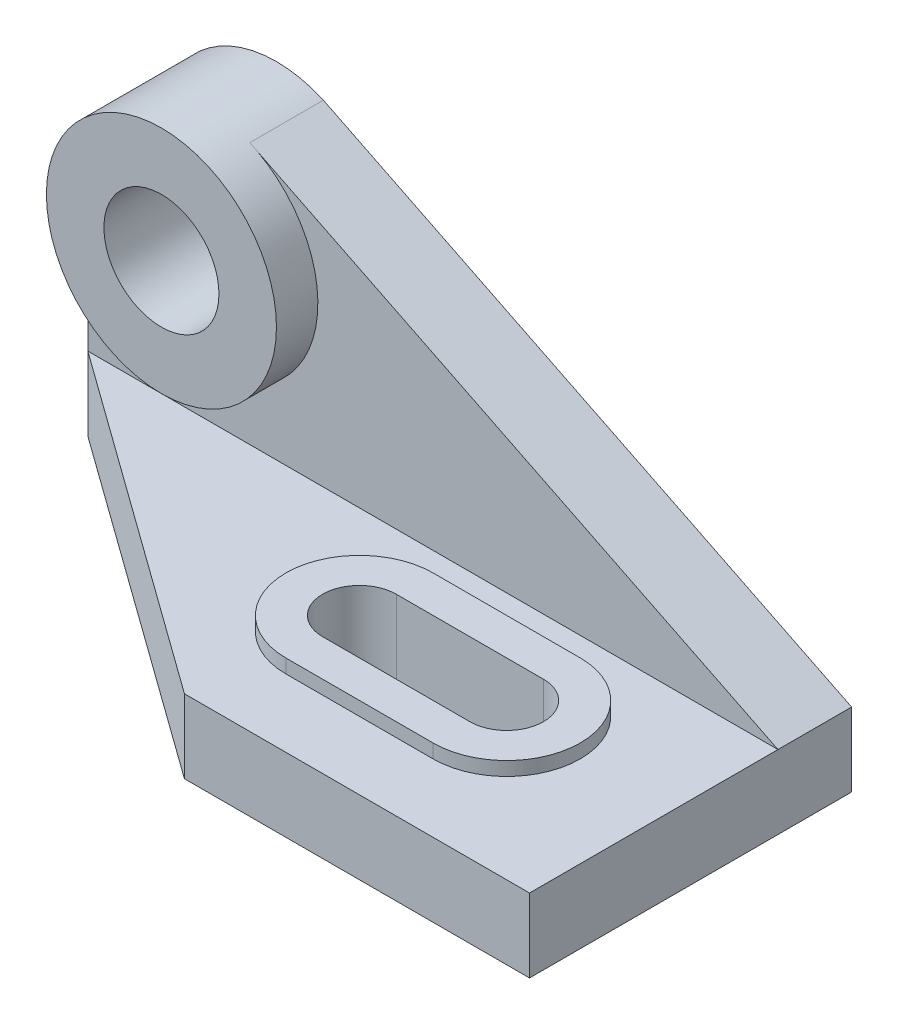
ISO-10303-21;
HEADER;
FILE_DESCRIPTION(('STEP AP214'),'2;1');
FILE_NAME('part.step','',(''),(''),'','','');
FILE_SCHEMA(('AUTOMOTIVE_DESIGN { 1 0 10303 214 1 1 1 1 }'));
ENDSEC;
DATA;
#1=APPLICATION_CONTEXT('core data for automotive mechanical design processes');
#2=APPLICATION_PROTOCOL_DEFINITION('international standard','automotive_design',2000,#1);
#3=PRODUCT_CONTEXT('',#1,'mechanical');
#4=PRODUCT('Part','Part','',(#3));
#5=PRODUCT_RELATED_PRODUCT_CATEGORY('part','',(#4));
#6=PRODUCT_DEFINITION_FORMATION('','',#4);
#7=PRODUCT_DEFINITION_CONTEXT('part definition',#1,'design');
#8=PRODUCT_DEFINITION('design','',#6,#7);
#9=PRODUCT_DEFINITION_SHAPE('','',#8);
#10=(LENGTH_UNIT() NAMED_UNIT(*) SI_UNIT(.MILLI.,.METRE.));
#11=(NAMED_UNIT(*) PLANE_ANGLE_UNIT() SI_UNIT($,.RADIAN.));
#12=(NAMED_UNIT(*) SI_UNIT($,.STERADIAN.) SOLID_ANGLE_UNIT());
#13=UNCERTAINTY_MEASURE_WITH_UNIT(LENGTH_MEASURE(1.E-05),#10,'distance_accuracy_value','');
#14=(GEOMETRIC_REPRESENTATION_CONTEXT(3) GLOBAL_UNCERTAINTY_ASSIGNED_CONTEXT((#13)) GLOBAL_UNIT_ASSIGNED_CONTEXT((#10,
#11,#12)) REPRESENTATION_CONTEXT('',''));
#15=CARTESIAN_POINT('',(0.,0.,0.));
#16=DIRECTION('',(0.,0.,1.));
#17=DIRECTION('',(1.,0.,0.));
#18=AXIS2_PLACEMENT_3D('',#15,#16,#17);
#19=CARTESIAN_POINT('',(47.7217497126448,3.,39.2415568663609));
#20=DIRECTION('',(0.,1.,0.));
#21=DIRECTION('',(0.,0.,1.));
#22=AXIS2_PLACEMENT_3D('',#19,#20,#21);
#23=PLANE('',#22);
#24=CARTESIAN_POINT('',(47.7217497126448,3.,39.2415568663609));
#25=DIRECTION('',(0.,1.,0.));
#26=DIRECTION('',(0.,0.,1.));
#27=AXIS2_PLACEMENT_3D('',#24,#25,#26);
#28=CIRCLE('',#27,16.);
#29=CARTESIAN_POINT('',(47.7217497126448,3.,55.2415568663609));
#30=VERTEX_POINT('',#29);
#31=CARTESIAN_POINT('',(47.7217497126448,3.,23.2415568663609));
#32=VERTEX_POINT('',#31);
#33=EDGE_CURVE('E309',#30,#32,#28,.T.);
#34=ORIENTED_EDGE('',*,*,#33,.T.);
#35=DIRECTION('',(-1.,0.,0.));
#36=VECTOR('',#35,1.);
#37=CARTESIAN_POINT('',(47.7217497126448,3.,23.2415568663609));
#38=LINE('',#37,#36);
#39=CARTESIAN_POINT('',(15.7217497126448,3.,23.2415568663609));
#40=VERTEX_POINT('',#39);
#41=EDGE_CURVE('E325',#32,#40,#38,.T.);
#42=ORIENTED_EDGE('',*,*,#41,.T.);
#43=CARTESIAN_POINT('',(15.7217497126448,3.,39.2415568663609));
#44=DIRECTION('',(0.,1.,0.));
#45=DIRECTION('',(0.,0.,1.));
#46=AXIS2_PLACEMENT_3D('',#43,#44,#45);
#47=CIRCLE('',#46,16.);
#48=CARTESIAN_POINT('',(15.7217497126448,3.,55.2415568663609));
#49=VERTEX_POINT('',#48);
#50=EDGE_CURVE('E322',#40,#49,#47,.T.);
#51=ORIENTED_EDGE('',*,*,#50,.T.);
#52=DIRECTION('',(1.,0.,0.));
#53=VECTOR('',#52,1.);
#54=CARTESIAN_POINT('',(47.7217497126448,3.,55.2415568663609));
#55=LINE('',#54,#53);
#56=EDGE_CURVE('E305',#49,#30,#55,.T.);
#57=ORIENTED_EDGE('',*,*,#56,.T.);
#58=EDGE_LOOP('',(#34,#42,#51,#57));
#59=FACE_BOUND('',#58,.T.);
#60=DIRECTION('',(1.,0.,0.));
#61=VECTOR('',#60,1.);
#62=CARTESIAN_POINT('',(47.7217497126448,3.,31.2415568663609));
#63=LINE('',#62,#61);
#64=CARTESIAN_POINT('',(15.7217497126448,3.,31.2415568663609));
#65=VERTEX_POINT('',#64);
#66=CARTESIAN_POINT('',(47.7217497126448,3.,31.2415568663609));
#67=VERTEX_POINT('',#66);
#68=EDGE_CURVE('E52',#65,#67,#63,.T.);
#69=ORIENTED_EDGE('',*,*,#68,.T.);
#70=CARTESIAN_POINT('',(47.7217497126448,3.,39.2415568663609));
#71=DIRECTION('',(0.,1.,0.));
#72=DIRECTION('',(0.,0.,1.));
#73=AXIS2_PLACEMENT_3D('',#70,#71,#72);
#74=CIRCLE('',#73,8.);
#75=CARTESIAN_POINT('',(47.7217497126448,3.,47.2415568663609));
#76=VERTEX_POINT('',#75);
#77=EDGE_CURVE('E11',#67,#76,#74,.F.);
#78=ORIENTED_EDGE('',*,*,#77,.T.);
#79=DIRECTION('',(-1.,0.,0.));
#80=VECTOR('',#79,1.);
#81=CARTESIAN_POINT('',(47.7217497126448,3.,47.2415568663609));
#82=LINE('',#81,#80);
#83=CARTESIAN_POINT('',(15.7217497126448,3.,47.2415568663609));
#84=VERTEX_POINT('',#83);
#85=EDGE_CURVE('E166',#76,#84,#82,.T.);
#86=ORIENTED_EDGE('',*,*,#85,.T.);
#87=CARTESIAN_POINT('',(15.7217497126448,3.,39.2415568663609));
#88=DIRECTION('',(0.,1.,0.));
#89=DIRECTION('',(0.,0.,1.));
#90=AXIS2_PLACEMENT_3D('',#87,#88,#89);
#91=CIRCLE('',#90,8.);
#92=EDGE_CURVE('E171',#84,#65,#91,.F.);
#93=ORIENTED_EDGE('',*,*,#92,.T.);
#94=EDGE_LOOP('',(#69,#78,#86,#93));
#95=FACE_BOUND('',#94,.T.);
#96=ADVANCED_FACE('F43',(#59,#95),#23,.T.);
#97=CARTESIAN_POINT('',(0.,0.,0.));
#98=DIRECTION('',(0.,1.,0.));
#99=DIRECTION('',(0.,0.,1.));
#100=AXIS2_PLACEMENT_3D('',#97,#98,#99);
#101=PLANE('',#100);
#102=DIRECTION('',(1.,0.,0.));
#103=VECTOR('',#102,1.);
#104=CARTESIAN_POINT('',(83.4429861704843,0.,16.));
#105=LINE('',#104,#103);
#106=CARTESIAN_POINT('',(-66.5570138295157,0.,16.));
#107=VERTEX_POINT('',#106);
#108=CARTESIAN_POINT('',(83.4429861704843,0.,16.));
#109=VERTEX_POINT('',#108);
#110=EDGE_CURVE('E254',#107,#109,#105,.T.);
#111=ORIENTED_EDGE('',*,*,#110,.F.);
#112=DIRECTION('',(-0.811534341451494,0.,-0.584304725845076));
#113=VECTOR('',#112,1.);
#114=CARTESIAN_POINT('',(8.44298617048435,0.,70.));
#115=LINE('',#114,#113);
#116=CARTESIAN_POINT('',(8.44298617048435,0.,70.));
#117=VERTEX_POINT('',#116);
#118=EDGE_CURVE('E247',#117,#107,#115,.T.);
#119=ORIENTED_EDGE('',*,*,#118,.F.);
#120=DIRECTION('',(-1.,0.,0.));
#121=VECTOR('',#120,1.);
#122=CARTESIAN_POINT('',(83.4429861704843,0.,70.));
#123=LINE('',#122,#121);
#124=CARTESIAN_POINT('',(83.4429861704843,0.,70.));
#125=VERTEX_POINT('',#124);
#126=EDGE_CURVE('E261',#125,#117,#123,.T.);
#127=ORIENTED_EDGE('',*,*,#126,.F.);
#128=DIRECTION('',(0.,0.,1.));
#129=VECTOR('',#128,1.);
#130=CARTESIAN_POINT('',(83.4429861704843,0.,16.));
#131=LINE('',#130,#129);
#132=EDGE_CURVE('E265',#109,#125,#131,.T.);
#133=ORIENTED_EDGE('',*,*,#132,.F.);
#134=EDGE_LOOP('',(#111,#119,#127,#133));
#135=FACE_BOUND('',#134,.T.);
#136=DIRECTION('',(-1.,0.,0.));
#137=VECTOR('',#136,1.);
#138=CARTESIAN_POINT('',(47.7217497126448,0.,23.2415568663609));
#139=LINE('',#138,#137);
#140=CARTESIAN_POINT('',(47.7217497126448,0.,23.2415568663609));
#141=VERTEX_POINT('',#140);
#142=CARTESIAN_POINT('',(15.7217497126448,0.,23.2415568663609));
#143=VERTEX_POINT('',#142);
#144=EDGE_CURVE('E313',#141,#143,#139,.T.);
#145=ORIENTED_EDGE('',*,*,#144,.F.);
#146=CARTESIAN_POINT('',(47.7217497126448,0.,39.2415568663609));
#147=DIRECTION('',(0.,1.,0.));
#148=DIRECTION('',(0.,0.,1.));
#149=AXIS2_PLACEMENT_3D('',#146,#147,#148);
#150=CIRCLE('',#149,16.);
#151=CARTESIAN_POINT('',(47.7217497126448,0.,55.2415568663609));
#152=VERTEX_POINT('',#151);
#153=EDGE_CURVE('E316',#152,#141,#150,.T.);
#154=ORIENTED_EDGE('',*,*,#153,.F.);
#155=DIRECTION('',(1.,0.,0.));
#156=VECTOR('',#155,1.);
#157=CARTESIAN_POINT('',(47.7217497126448,0.,55.2415568663609));
#158=LINE('',#157,#156);
#159=CARTESIAN_POINT('',(15.7217497126448,0.,55.2415568663609));
#160=VERTEX_POINT('',#159);
#161=EDGE_CURVE('E306',#160,#152,#158,.T.);
#162=ORIENTED_EDGE('',*,*,#161,.F.);
#163=CARTESIAN_POINT('',(15.7217497126448,0.,39.2415568663609));
#164=DIRECTION('',(0.,1.,0.));
#165=DIRECTION('',(0.,0.,1.));
#166=AXIS2_PLACEMENT_3D('',#163,#164,#165);
#167=CIRCLE('',#166,16.);
#168=EDGE_CURVE('E310',#143,#160,#167,.T.);
#169=ORIENTED_EDGE('',*,*,#168,.F.);
#170=EDGE_LOOP('',(#145,#154,#162,#169));
#171=FACE_BOUND('',#170,.T.);
#172=ADVANCED_FACE('F348',(#135,#171),#101,.T.);
#173=CARTESIAN_POINT('',(16.4210951725497,33.1748828290521,16.));
#174=DIRECTION('',(-0.443614915856847,-0.896217499510762,0.));
#175=DIRECTION('',(0.896217499510762,-0.443614915856847,0.));
#176=AXIS2_PLACEMENT_3D('',#173,#174,#175);
#177=PLANE('',#176);
#178=DIRECTION('',(-0.896217499510762,0.443614915856847,0.));
#179=VECTOR('',#178,1.);
#180=CARTESIAN_POINT('',(16.4210951725497,33.1748828290521,0.));
#181=LINE('',#180,#179);
#182=CARTESIAN_POINT('',(83.4429861704843,0.,0.));
#183=VERTEX_POINT('',#182);
#184=CARTESIAN_POINT('',(-31.3607676730785,56.8262253628878,0.));
#185=VERTEX_POINT('',#184);
#186=EDGE_CURVE('E215',#183,#185,#181,.T.);
#187=ORIENTED_EDGE('',*,*,#186,.T.);
#188=DIRECTION('',(0.,0.,-1.));
#189=VECTOR('',#188,1.);
#190=CARTESIAN_POINT('',(-31.3607676730785,56.8262253628878,16.));
#191=LINE('',#190,#189);
#192=CARTESIAN_POINT('',(-31.3607676730785,56.8262253628878,16.));
#193=VERTEX_POINT('',#192);
#194=EDGE_CURVE('E181',#193,#185,#191,.T.);
#195=ORIENTED_EDGE('',*,*,#194,.F.);
#196=DIRECTION('',(-0.896217499510762,0.443614915856847,0.));
#197=VECTOR('',#196,1.);
#198=CARTESIAN_POINT('',(16.4210951725497,33.1748828290521,16.));
#199=LINE('',#198,#197);
#200=CARTESIAN_POINT('',(-29.5898422364568,55.9496424586435,16.));
#201=VERTEX_POINT('',#200);
#202=EDGE_CURVE('E202',#201,#193,#199,.T.);
#203=ORIENTED_EDGE('',*,*,#202,.F.);
#204=EDGE_CURVE('E228',#109,#201,#199,.T.);
#205=ORIENTED_EDGE('',*,*,#204,.F.);
#206=DIRECTION('',(0.,0.,-1.));
#207=VECTOR('',#206,1.);
#208=CARTESIAN_POINT('',(83.4429861704843,0.,16.));
#209=LINE('',#208,#207);
#210=EDGE_CURVE('E194',#109,#183,#209,.T.);
#211=ORIENTED_EDGE('',*,*,#210,.T.);
#212=EDGE_LOOP('',(#187,#195,#203,#205,#211));
#213=FACE_BOUND('',#212,.T.);
#214=ADVANCED_FACE('F350',(#213),#177,.F.);
#215=CARTESIAN_POINT('',(-41.5570138295156,34.,16.));
#216=DIRECTION('',(0.,0.,-1.));
#217=DIRECTION('',(-1.,0.,0.));
#218=AXIS2_PLACEMENT_3D('',#215,#216,#217);
#219=CYLINDRICAL_SURFACE('',#218,25.);
#220=CARTESIAN_POINT('',(-41.5570138295156,34.,0.));
#221=DIRECTION('',(0.,0.,1.));
#222=DIRECTION('',(1.,0.,0.));
#223=AXIS2_PLACEMENT_3D('',#220,#221,#222);
#224=CIRCLE('',#223,25.);
#225=CARTESIAN_POINT('',(-66.5570138295157,34.,0.));
#226=VERTEX_POINT('',#225);
#227=EDGE_CURVE('E211',#185,#226,#224,.T.);
#228=ORIENTED_EDGE('',*,*,#227,.T.);
#229=DIRECTION('',(0.,0.,-1.));
#230=VECTOR('',#229,1.);
#231=CARTESIAN_POINT('',(-66.5570138295157,34.,16.));
#232=LINE('',#231,#230);
#233=CARTESIAN_POINT('',(-66.5570138295157,34.,16.));
#234=VERTEX_POINT('',#233);
#235=EDGE_CURVE('E185',#234,#226,#232,.T.);
#236=ORIENTED_EDGE('',*,*,#235,.F.);
#237=CARTESIAN_POINT('',(-41.5570138295156,34.,16.));
#238=DIRECTION('',(0.,0.,1.));
#239=DIRECTION('',(1.,0.,0.));
#240=AXIS2_PLACEMENT_3D('',#237,#238,#239);
#241=CIRCLE('',#240,25.);
#242=EDGE_CURVE('E172',#234,#201,#241,.T.);
#243=ORIENTED_EDGE('',*,*,#242,.T.);
#244=EDGE_CURVE('E231',#201,#193,#241,.T.);
#245=ORIENTED_EDGE('',*,*,#244,.T.);
#246=ORIENTED_EDGE('',*,*,#194,.T.);
#247=EDGE_LOOP('',(#228,#236,#243,#245,#246));
#248=FACE_BOUND('',#247,.T.);
#249=CARTESIAN_POINT('',(-41.5570138295156,34.,25.));
#250=DIRECTION('',(0.,0.,1.));
#251=DIRECTION('',(1.,0.,0.));
#252=AXIS2_PLACEMENT_3D('',#249,#250,#251);
#253=CIRCLE('',#252,25.);
#254=CARTESIAN_POINT('',(-16.5570138295156,34.,25.));
#255=VERTEX_POINT('',#254);
#256=EDGE_CURVE('E223',#255,#255,#253,.T.);
#257=ORIENTED_EDGE('',*,*,#256,.F.);
#258=EDGE_LOOP('',(#257));
#259=FACE_BOUND('',#258,.T.);
#260=ADVANCED_FACE('F357',(#248,#259),#219,.T.);
#261=CARTESIAN_POINT('',(-66.5570138295157,0.,16.));
#262=DIRECTION('',(-1.,0.,0.));
#263=DIRECTION('',(0.,0.,1.));
#264=AXIS2_PLACEMENT_3D('',#261,#262,#263);
#265=PLANE('',#264);
#266=DIRECTION('',(0.,1.,0.));
#267=VECTOR('',#266,1.);
#268=CARTESIAN_POINT('',(-66.5570138295157,0.,0.));
#269=LINE('',#268,#267);
#270=CARTESIAN_POINT('',(-66.5570138295157,-16.,0.));
#271=VERTEX_POINT('',#270);
#272=EDGE_CURVE('E207',#271,#226,#269,.T.);
#273=ORIENTED_EDGE('',*,*,#272,.F.);
#274=DIRECTION('',(0.,0.,-1.));
#275=VECTOR('',#274,1.);
#276=CARTESIAN_POINT('',(-66.5570138295157,-16.,16.));
#277=LINE('',#276,#275);
#278=CARTESIAN_POINT('',(-66.5570138295157,-16.,16.));
#279=VERTEX_POINT('',#278);
#280=EDGE_CURVE('E188',#279,#271,#277,.T.);
#281=ORIENTED_EDGE('',*,*,#280,.F.);
#282=DIRECTION('',(0.,1.,0.));
#283=VECTOR('',#282,1.);
#284=CARTESIAN_POINT('',(-66.5570138295157,0.,16.));
#285=LINE('',#284,#283);
#286=EDGE_CURVE('E197',#279,#107,#285,.T.);
#287=ORIENTED_EDGE('',*,*,#286,.T.);
#288=EDGE_CURVE('E227',#107,#234,#285,.T.);
#289=ORIENTED_EDGE('',*,*,#288,.T.);
#290=ORIENTED_EDGE('',*,*,#235,.T.);
#291=EDGE_LOOP('',(#273,#281,#287,#289,#290));
#292=FACE_BOUND('',#291,.T.);
#293=ADVANCED_FACE('F395',(#292),#265,.T.);
#294=CARTESIAN_POINT('',(0.,-16.,16.));
#295=DIRECTION('',(0.,1.,0.));
#296=DIRECTION('',(0.,0.,1.));
#297=AXIS2_PLACEMENT_3D('',#294,#295,#296);
#298=PLANE('',#297);
#299=DIRECTION('',(1.,0.,0.));
#300=VECTOR('',#299,1.);
#301=CARTESIAN_POINT('',(47.7217497126448,-16.,47.2415568663609));
#302=LINE('',#301,#300);
#303=CARTESIAN_POINT('',(15.7217497126448,-16.,47.2415568663609));
#304=VERTEX_POINT('',#303);
#305=CARTESIAN_POINT('',(47.7217497126448,-16.,47.2415568663609));
#306=VERTEX_POINT('',#305);
#307=EDGE_CURVE('E275',#304,#306,#302,.T.);
#308=ORIENTED_EDGE('',*,*,#307,.T.);
#309=CARTESIAN_POINT('',(47.7217497126448,-16.,39.2415568663609));
#310=DIRECTION('',(0.,1.,0.));
#311=DIRECTION('',(0.,0.,1.));
#312=AXIS2_PLACEMENT_3D('',#309,#310,#311);
#313=CIRCLE('',#312,8.);
#314=CARTESIAN_POINT('',(47.7217497126448,-16.,31.2415568663609));
#315=VERTEX_POINT('',#314);
#316=EDGE_CURVE('E160',#306,#315,#313,.T.);
#317=ORIENTED_EDGE('',*,*,#316,.T.);
#318=DIRECTION('',(-1.,0.,0.));
#319=VECTOR('',#318,1.);
#320=CARTESIAN_POINT('',(47.7217497126448,-16.,31.2415568663609));
#321=LINE('',#320,#319);
#322=CARTESIAN_POINT('',(15.7217497126448,-16.,31.2415568663609));
#323=VERTEX_POINT('',#322);
#324=EDGE_CURVE('E286',#315,#323,#321,.T.);
#325=ORIENTED_EDGE('',*,*,#324,.T.);
#326=CARTESIAN_POINT('',(15.7217497126448,-16.,39.2415568663609));
#327=DIRECTION('',(0.,1.,0.));
#328=DIRECTION('',(0.,0.,1.));
#329=AXIS2_PLACEMENT_3D('',#326,#327,#328);
#330=CIRCLE('',#329,8.);
#331=EDGE_CURVE('E282',#323,#304,#330,.T.);
#332=ORIENTED_EDGE('',*,*,#331,.T.);
#333=EDGE_LOOP('',(#308,#317,#325,#332));
#334=FACE_BOUND('',#333,.T.);
#335=DIRECTION('',(1.,0.,0.));
#336=VECTOR('',#335,1.);
#337=CARTESIAN_POINT('',(0.,-16.,0.));
#338=LINE('',#337,#336);
#339=CARTESIAN_POINT('',(83.4429861704843,-16.,0.));
#340=VERTEX_POINT('',#339);
#341=EDGE_CURVE('E203',#271,#340,#338,.T.);
#342=ORIENTED_EDGE('',*,*,#341,.T.);
#343=DIRECTION('',(0.,0.,-1.));
#344=VECTOR('',#343,1.);
#345=CARTESIAN_POINT('',(83.4429861704843,-16.,16.));
#346=LINE('',#345,#344);
#347=CARTESIAN_POINT('',(83.4429861704843,-16.,70.));
#348=VERTEX_POINT('',#347);
#349=EDGE_CURVE('E191',#348,#340,#346,.T.);
#350=ORIENTED_EDGE('',*,*,#349,.F.);
#351=DIRECTION('',(-1.,0.,0.));
#352=VECTOR('',#351,1.);
#353=CARTESIAN_POINT('',(83.4429861704843,-16.,70.));
#354=LINE('',#353,#352);
#355=CARTESIAN_POINT('',(8.44298617048435,-16.,70.));
#356=VERTEX_POINT('',#355);
#357=EDGE_CURVE('E163',#348,#356,#354,.T.);
#358=ORIENTED_EDGE('',*,*,#357,.T.);
#359=DIRECTION('',(-0.811534341451494,0.,-0.584304725845076));
#360=VECTOR('',#359,1.);
#361=CARTESIAN_POINT('',(8.44298617048435,-16.,70.));
#362=LINE('',#361,#360);
#363=EDGE_CURVE('E250',#356,#279,#362,.T.);
#364=ORIENTED_EDGE('',*,*,#363,.T.);
#365=ORIENTED_EDGE('',*,*,#280,.T.);
#366=EDGE_LOOP('',(#342,#350,#358,#364,#365));
#367=FACE_BOUND('',#366,.T.);
#368=ADVANCED_FACE('F392',(#334,#367),#298,.F.);
#369=CARTESIAN_POINT('',(-41.5570138295156,34.,16.));
#370=DIRECTION('',(0.,0.,-1.));
#371=DIRECTION('',(-1.,0.,0.));
#372=AXIS2_PLACEMENT_3D('',#369,#370,#371);
#373=CYLINDRICAL_SURFACE('',#372,12.5);
#374=CARTESIAN_POINT('',(-41.5570138295156,34.,0.));
#375=DIRECTION('',(0.,0.,1.));
#376=DIRECTION('',(1.,0.,0.));
#377=AXIS2_PLACEMENT_3D('',#374,#375,#376);
#378=CIRCLE('',#377,12.5);
#379=CARTESIAN_POINT('',(-29.0570138295156,34.,0.));
#380=VERTEX_POINT('',#379);
#381=EDGE_CURVE('E219',#380,#380,#378,.T.);
#382=ORIENTED_EDGE('',*,*,#381,.F.);
#383=EDGE_LOOP('',(#382));
#384=FACE_BOUND('',#383,.T.);
#385=CARTESIAN_POINT('',(-41.5570138295156,34.,25.));
#386=DIRECTION('',(0.,0.,1.));
#387=DIRECTION('',(1.,0.,0.));
#388=AXIS2_PLACEMENT_3D('',#385,#386,#387);
#389=CIRCLE('',#388,12.5);
#390=CARTESIAN_POINT('',(-29.0570138295156,34.,25.));
#391=VERTEX_POINT('',#390);
#392=EDGE_CURVE('E235',#391,#391,#389,.T.);
#393=ORIENTED_EDGE('',*,*,#392,.T.);
#394=EDGE_LOOP('',(#393));
#395=FACE_BOUND('',#394,.T.);
#396=ADVANCED_FACE('F45',(#384,#395),#373,.F.);
#397=CARTESIAN_POINT('',(83.4429861704843,0.,16.));
#398=DIRECTION('',(1.,0.,0.));
#399=DIRECTION('',(0.,0.,-1.));
#400=AXIS2_PLACEMENT_3D('',#397,#398,#399);
#401=PLANE('',#400);
#402=DIRECTION('',(0.,-1.,0.));
#403=VECTOR('',#402,1.);
#404=CARTESIAN_POINT('',(83.4429861704843,0.,0.));
#405=LINE('',#404,#403);
#406=EDGE_CURVE('E198',#183,#340,#405,.T.);
#407=ORIENTED_EDGE('',*,*,#406,.F.);
#408=ORIENTED_EDGE('',*,*,#210,.F.);
#409=ORIENTED_EDGE('',*,*,#132,.T.);
#410=DIRECTION('',(0.,-1.,0.));
#411=VECTOR('',#410,1.);
#412=CARTESIAN_POINT('',(83.4429861704843,0.,70.));
#413=LINE('',#412,#411);
#414=EDGE_CURVE('E243',#125,#348,#413,.T.);
#415=ORIENTED_EDGE('',*,*,#414,.T.);
#416=ORIENTED_EDGE('',*,*,#349,.T.);
#417=EDGE_LOOP('',(#407,#408,#409,#415,#416));
#418=FACE_BOUND('',#417,.T.);
#419=ADVANCED_FACE('F384',(#418),#401,.T.);
#420=CARTESIAN_POINT('',(0.,0.,16.));
#421=DIRECTION('',(0.,0.,1.));
#422=DIRECTION('',(1.,0.,0.));
#423=AXIS2_PLACEMENT_3D('',#420,#421,#422);
#424=PLANE('',#423);
#425=ORIENTED_EDGE('',*,*,#110,.T.);
#426=ORIENTED_EDGE('',*,*,#204,.T.);
#427=ORIENTED_EDGE('',*,*,#242,.F.);
#428=ORIENTED_EDGE('',*,*,#288,.F.);
#429=EDGE_LOOP('',(#425,#426,#427,#428));
#430=FACE_BOUND('',#429,.T.);
#431=ADVANCED_FACE('F381',(#430),#424,.T.);
#432=CARTESIAN_POINT('',(0.,0.,0.));
#433=DIRECTION('',(0.,0.,1.));
#434=DIRECTION('',(1.,0.,0.));
#435=AXIS2_PLACEMENT_3D('',#432,#433,#434);
#436=PLANE('',#435);
#437=ORIENTED_EDGE('',*,*,#381,.T.);
#438=EDGE_LOOP('',(#437));
#439=FACE_BOUND('',#438,.T.);
#440=ORIENTED_EDGE('',*,*,#186,.F.);
#441=ORIENTED_EDGE('',*,*,#406,.T.);
#442=ORIENTED_EDGE('',*,*,#341,.F.);
#443=ORIENTED_EDGE('',*,*,#272,.T.);
#444=ORIENTED_EDGE('',*,*,#227,.F.);
#445=EDGE_LOOP('',(#440,#441,#442,#443,#444));
#446=FACE_BOUND('',#445,.T.);
#447=ADVANCED_FACE('F379',(#439,#446),#436,.F.);
#448=CARTESIAN_POINT('',(-41.5570138295156,34.,16.));
#449=DIRECTION('',(0.,0.,1.));
#450=DIRECTION('',(1.,0.,0.));
#451=AXIS2_PLACEMENT_3D('',#448,#449,#450);
#452=PLANE('',#451);
#453=ORIENTED_EDGE('',*,*,#244,.F.);
#454=ORIENTED_EDGE('',*,*,#202,.T.);
#455=EDGE_LOOP('',(#453,#454));
#456=FACE_BOUND('',#455,.T.);
#457=ADVANCED_FACE('F375',(#456),#452,.F.);
#458=CARTESIAN_POINT('',(-41.5570138295156,34.,25.));
#459=DIRECTION('',(0.,0.,1.));
#460=DIRECTION('',(1.,0.,0.));
#461=AXIS2_PLACEMENT_3D('',#458,#459,#460);
#462=PLANE('',#461);
#463=ORIENTED_EDGE('',*,*,#256,.T.);
#464=EDGE_LOOP('',(#463));
#465=FACE_BOUND('',#464,.T.);
#466=ORIENTED_EDGE('',*,*,#392,.F.);
#467=EDGE_LOOP('',(#466));
#468=FACE_BOUND('',#467,.T.);
#469=ADVANCED_FACE('F368',(#465,#468),#462,.T.);
#470=CARTESIAN_POINT('',(8.44298617048435,0.,70.));
#471=DIRECTION('',(-0.584304725845076,0.,0.811534341451494));
#472=DIRECTION('',(0.811534341451494,0.,0.584304725845076));
#473=AXIS2_PLACEMENT_3D('',#470,#471,#472);
#474=PLANE('',#473);
#475=ORIENTED_EDGE('',*,*,#363,.F.);
#476=DIRECTION('',(0.,-1.,0.));
#477=VECTOR('',#476,1.);
#478=CARTESIAN_POINT('',(8.44298617048435,0.,70.));
#479=LINE('',#478,#477);
#480=EDGE_CURVE('E242',#117,#356,#479,.T.);
#481=ORIENTED_EDGE('',*,*,#480,.F.);
#482=ORIENTED_EDGE('',*,*,#118,.T.);
#483=ORIENTED_EDGE('',*,*,#286,.F.);
#484=EDGE_LOOP('',(#475,#481,#482,#483));
#485=FACE_BOUND('',#484,.T.);
#486=ADVANCED_FACE('F364',(#485),#474,.T.);
#487=CARTESIAN_POINT('',(83.4429861704843,0.,70.));
#488=DIRECTION('',(0.,0.,1.));
#489=DIRECTION('',(1.,0.,0.));
#490=AXIS2_PLACEMENT_3D('',#487,#488,#489);
#491=PLANE('',#490);
#492=ORIENTED_EDGE('',*,*,#357,.F.);
#493=ORIENTED_EDGE('',*,*,#414,.F.);
#494=ORIENTED_EDGE('',*,*,#126,.T.);
#495=ORIENTED_EDGE('',*,*,#480,.T.);
#496=EDGE_LOOP('',(#492,#493,#494,#495));
#497=FACE_BOUND('',#496,.T.);
#498=ADVANCED_FACE('F367',(#497),#491,.T.);
#499=CARTESIAN_POINT('',(47.7217497126448,-16.,39.2415568663609));
#500=DIRECTION('',(0.,1.,0.));
#501=DIRECTION('',(0.,0.,1.));
#502=AXIS2_PLACEMENT_3D('',#499,#500,#501);
#503=CYLINDRICAL_SURFACE('',#502,8.);
#504=DIRECTION('',(0.,1.,0.));
#505=VECTOR('',#504,1.);
#506=CARTESIAN_POINT('',(47.7217497126448,-16.,47.2415568663609));
#507=LINE('',#506,#505);
#508=EDGE_CURVE('E156',#306,#76,#507,.T.);
#509=ORIENTED_EDGE('',*,*,#508,.T.);
#510=ORIENTED_EDGE('',*,*,#77,.F.);
#511=DIRECTION('',(0.,1.,0.));
#512=VECTOR('',#511,1.);
#513=CARTESIAN_POINT('',(47.7217497126448,-16.,31.2415568663609));
#514=LINE('',#513,#512);
#515=EDGE_CURVE('E271',#315,#67,#514,.T.);
#516=ORIENTED_EDGE('',*,*,#515,.F.);
#517=ORIENTED_EDGE('',*,*,#316,.F.);
#518=EDGE_LOOP('',(#509,#510,#516,#517));
#519=FACE_BOUND('',#518,.T.);
#520=ADVANCED_FACE('F157',(#519),#503,.F.);
#521=CARTESIAN_POINT('',(47.7217497126448,-16.,47.2415568663609));
#522=DIRECTION('',(0.,0.,1.));
#523=DIRECTION('',(1.,0.,0.));
#524=AXIS2_PLACEMENT_3D('',#521,#522,#523);
#525=PLANE('',#524);
#526=DIRECTION('',(0.,1.,0.));
#527=VECTOR('',#526,1.);
#528=CARTESIAN_POINT('',(15.7217497126448,-16.,47.2415568663609));
#529=LINE('',#528,#527);
#530=EDGE_CURVE('E59',#304,#84,#529,.T.);
#531=ORIENTED_EDGE('',*,*,#530,.T.);
#532=ORIENTED_EDGE('',*,*,#85,.F.);
#533=ORIENTED_EDGE('',*,*,#508,.F.);
#534=ORIENTED_EDGE('',*,*,#307,.F.);
#535=EDGE_LOOP('',(#531,#532,#533,#534));
#536=FACE_BOUND('',#535,.T.);
#537=ADVANCED_FACE('F167',(#536),#525,.F.);
#538=CARTESIAN_POINT('',(15.7217497126448,-16.,39.2415568663609));
#539=DIRECTION('',(0.,1.,0.));
#540=DIRECTION('',(0.,0.,1.));
#541=AXIS2_PLACEMENT_3D('',#538,#539,#540);
#542=CYLINDRICAL_SURFACE('',#541,8.);
#543=DIRECTION('',(0.,1.,0.));
#544=VECTOR('',#543,1.);
#545=CARTESIAN_POINT('',(15.7217497126448,-16.,31.2415568663609));
#546=LINE('',#545,#544);
#547=EDGE_CURVE('E274',#323,#65,#546,.T.);
#548=ORIENTED_EDGE('',*,*,#547,.T.);
#549=ORIENTED_EDGE('',*,*,#92,.F.);
#550=ORIENTED_EDGE('',*,*,#530,.F.);
#551=ORIENTED_EDGE('',*,*,#331,.F.);
#552=EDGE_LOOP('',(#548,#549,#550,#551));
#553=FACE_BOUND('',#552,.T.);
#554=ADVANCED_FACE('F481',(#553),#542,.F.);
#555=CARTESIAN_POINT('',(47.7217497126448,-16.,31.2415568663609));
#556=DIRECTION('',(0.,0.,-1.));
#557=DIRECTION('',(-1.,0.,0.));
#558=AXIS2_PLACEMENT_3D('',#555,#556,#557);
#559=PLANE('',#558);
#560=ORIENTED_EDGE('',*,*,#515,.T.);
#561=ORIENTED_EDGE('',*,*,#68,.F.);
#562=ORIENTED_EDGE('',*,*,#547,.F.);
#563=ORIENTED_EDGE('',*,*,#324,.F.);
#564=EDGE_LOOP('',(#560,#561,#562,#563));
#565=FACE_BOUND('',#564,.T.);
#566=ADVANCED_FACE('F488',(#565),#559,.F.);
#567=CARTESIAN_POINT('',(47.7217497126448,3.,39.2415568663609));
#568=DIRECTION('',(0.,-1.,0.));
#569=DIRECTION('',(0.,0.,-1.));
#570=AXIS2_PLACEMENT_3D('',#567,#568,#569);
#571=CYLINDRICAL_SURFACE('',#570,16.);
#572=ORIENTED_EDGE('',*,*,#153,.T.);
#573=DIRECTION('',(0.,-1.,0.));
#574=VECTOR('',#573,1.);
#575=CARTESIAN_POINT('',(47.7217497126448,3.,23.2415568663609));
#576=LINE('',#575,#574);
#577=EDGE_CURVE('E292',#32,#141,#576,.T.);
#578=ORIENTED_EDGE('',*,*,#577,.F.);
#579=ORIENTED_EDGE('',*,*,#33,.F.);
#580=DIRECTION('',(0.,-1.,0.));
#581=VECTOR('',#580,1.);
#582=CARTESIAN_POINT('',(47.7217497126448,3.,55.2415568663609));
#583=LINE('',#582,#581);
#584=EDGE_CURVE('E301',#30,#152,#583,.T.);
#585=ORIENTED_EDGE('',*,*,#584,.T.);
#586=EDGE_LOOP('',(#572,#578,#579,#585));
#587=FACE_BOUND('',#586,.T.);
#588=ADVANCED_FACE('F336',(#587),#571,.T.);
#589=CARTESIAN_POINT('',(47.7217497126448,3.,23.2415568663609));
#590=DIRECTION('',(0.,0.,1.));
#591=DIRECTION('',(1.,0.,0.));
#592=AXIS2_PLACEMENT_3D('',#589,#590,#591);
#593=PLANE('',#592);
#594=ORIENTED_EDGE('',*,*,#144,.T.);
#595=DIRECTION('',(0.,-1.,0.));
#596=VECTOR('',#595,1.);
#597=CARTESIAN_POINT('',(15.7217497126448,3.,23.2415568663609));
#598=LINE('',#597,#596);
#599=EDGE_CURVE('E295',#40,#143,#598,.T.);
#600=ORIENTED_EDGE('',*,*,#599,.F.);
#601=ORIENTED_EDGE('',*,*,#41,.F.);
#602=ORIENTED_EDGE('',*,*,#577,.T.);
#603=EDGE_LOOP('',(#594,#600,#601,#602));
#604=FACE_BOUND('',#603,.T.);
#605=ADVANCED_FACE('F340',(#604),#593,.F.);
#606=CARTESIAN_POINT('',(15.7217497126448,3.,39.2415568663609));
#607=DIRECTION('',(0.,-1.,0.));
#608=DIRECTION('',(0.,0.,-1.));
#609=AXIS2_PLACEMENT_3D('',#606,#607,#608);
#610=CYLINDRICAL_SURFACE('',#609,16.);
#611=ORIENTED_EDGE('',*,*,#168,.T.);
#612=DIRECTION('',(0.,-1.,0.));
#613=VECTOR('',#612,1.);
#614=CARTESIAN_POINT('',(15.7217497126448,3.,55.2415568663609));
#615=LINE('',#614,#613);
#616=EDGE_CURVE('E67',#49,#160,#615,.T.);
#617=ORIENTED_EDGE('',*,*,#616,.F.);
#618=ORIENTED_EDGE('',*,*,#50,.F.);
#619=ORIENTED_EDGE('',*,*,#599,.T.);
#620=EDGE_LOOP('',(#611,#617,#618,#619));
#621=FACE_BOUND('',#620,.T.);
#622=ADVANCED_FACE('F344',(#621),#610,.T.);
#623=CARTESIAN_POINT('',(47.7217497126448,3.,55.2415568663609));
#624=DIRECTION('',(0.,0.,-1.));
#625=DIRECTION('',(-1.,0.,0.));
#626=AXIS2_PLACEMENT_3D('',#623,#624,#625);
#627=PLANE('',#626);
#628=ORIENTED_EDGE('',*,*,#161,.T.);
#629=ORIENTED_EDGE('',*,*,#584,.F.);
#630=ORIENTED_EDGE('',*,*,#56,.F.);
#631=ORIENTED_EDGE('',*,*,#616,.T.);
#632=EDGE_LOOP('',(#628,#629,#630,#631));
#633=FACE_BOUND('',#632,.T.);
#634=ADVANCED_FACE('F346',(#633),#627,.F.);
#635=CLOSED_SHELL('',(#96,#172,#214,#260,#293,#368,#396,#419,#431,#447,#457,#469,#486,#498,#520,
#537,#554,#566,#588,#605,#622,#634));
#636=MANIFOLD_SOLID_BREP('B2',#635);
#637=ADVANCED_BREP_SHAPE_REPRESENTATION('',(#18,#636),#14);
#638=SHAPE_DEFINITION_REPRESENTATION(#9,#637);
ENDSEC;
END-ISO-10303-21;
